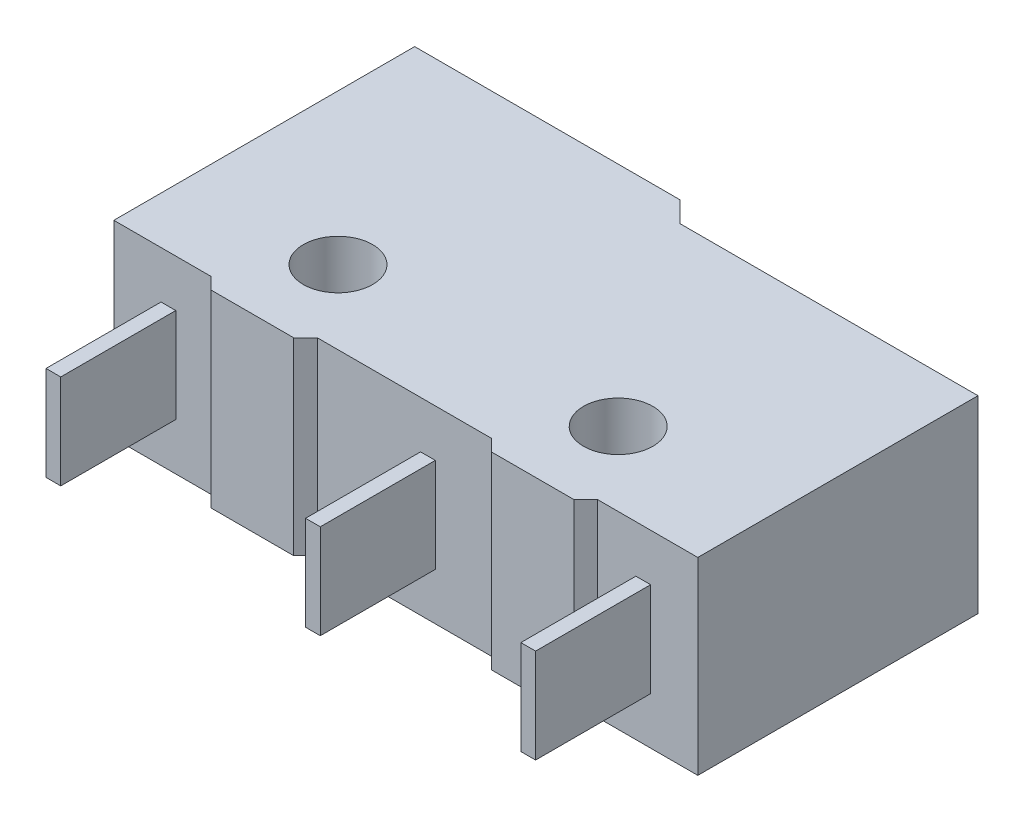
ISO-10303-21;
HEADER;
FILE_DESCRIPTION(('STEP AP214'),'2;1');
FILE_NAME('part.step','',(''),(''),'','','');
FILE_SCHEMA(('AUTOMOTIVE_DESIGN { 1 0 10303 214 1 1 1 1 }'));
ENDSEC;
DATA;
#1=APPLICATION_CONTEXT('core data for automotive mechanical design processes');
#2=APPLICATION_PROTOCOL_DEFINITION('international standard','automotive_design',2000,#1);
#3=PRODUCT_CONTEXT('',#1,'mechanical');
#4=PRODUCT('Part','Part','',(#3));
#5=PRODUCT_RELATED_PRODUCT_CATEGORY('part','',(#4));
#6=PRODUCT_DEFINITION_FORMATION('','',#4);
#7=PRODUCT_DEFINITION_CONTEXT('part definition',#1,'design');
#8=PRODUCT_DEFINITION('design','',#6,#7);
#9=PRODUCT_DEFINITION_SHAPE('','',#8);
#10=(LENGTH_UNIT() NAMED_UNIT(*) SI_UNIT(.MILLI.,.METRE.));
#11=(NAMED_UNIT(*) PLANE_ANGLE_UNIT() SI_UNIT($,.RADIAN.));
#12=(NAMED_UNIT(*) SI_UNIT($,.STERADIAN.) SOLID_ANGLE_UNIT());
#13=UNCERTAINTY_MEASURE_WITH_UNIT(LENGTH_MEASURE(1.E-05),#10,'distance_accuracy_value','');
#14=(GEOMETRIC_REPRESENTATION_CONTEXT(3) GLOBAL_UNCERTAINTY_ASSIGNED_CONTEXT((#13)) GLOBAL_UNIT_ASSIGNED_CONTEXT((#10,
#11,#12)) REPRESENTATION_CONTEXT('',''));
#15=CARTESIAN_POINT('',(0.,0.,0.));
#16=DIRECTION('',(0.,0.,1.));
#17=DIRECTION('',(1.,0.,0.));
#18=AXIS2_PLACEMENT_3D('',#15,#16,#17);
#19=CARTESIAN_POINT('',(11.3,6.4,2.5));
#20=DIRECTION('',(0.,0.,-1.));
#21=DIRECTION('',(-1.,0.,0.));
#22=AXIS2_PLACEMENT_3D('',#19,#20,#21);
#23=PLANE('',#22);
#24=DIRECTION('',(1.,0.,0.));
#25=VECTOR('',#24,1.);
#26=CARTESIAN_POINT('',(11.3,0.,2.5));
#27=LINE('',#26,#25);
#28=CARTESIAN_POINT('',(11.3,0.,2.5));
#29=VERTEX_POINT('',#28);
#30=CARTESIAN_POINT('',(14.7,0.,2.5));
#31=VERTEX_POINT('',#30);
#32=EDGE_CURVE('E499',#29,#31,#27,.T.);
#33=ORIENTED_EDGE('',*,*,#32,.T.);
#34=DIRECTION('',(0.,-1.,0.));
#35=VECTOR('',#34,1.);
#36=CARTESIAN_POINT('',(14.7,6.4,2.5));
#37=LINE('',#36,#35);
#38=CARTESIAN_POINT('',(14.7,6.4,2.5));
#39=VERTEX_POINT('',#38);
#40=EDGE_CURVE('E502',#39,#31,#37,.T.);
#41=ORIENTED_EDGE('',*,*,#40,.F.);
#42=DIRECTION('',(1.,0.,0.));
#43=VECTOR('',#42,1.);
#44=CARTESIAN_POINT('',(11.3,6.4,2.5));
#45=LINE('',#44,#43);
#46=CARTESIAN_POINT('',(11.3,6.4,2.5));
#47=VERTEX_POINT('',#46);
#48=EDGE_CURVE('E506',#47,#39,#45,.T.);
#49=ORIENTED_EDGE('',*,*,#48,.F.);
#50=DIRECTION('',(0.,-1.,0.));
#51=VECTOR('',#50,1.);
#52=CARTESIAN_POINT('',(11.3,6.4,2.5));
#53=LINE('',#52,#51);
#54=EDGE_CURVE('E505',#47,#29,#53,.T.);
#55=ORIENTED_EDGE('',*,*,#54,.T.);
#56=EDGE_LOOP('',(#33,#41,#49,#55));
#57=FACE_BOUND('',#56,.T.);
#58=DIRECTION('',(-1.,0.,0.));
#59=VECTOR('',#58,1.);
#60=CARTESIAN_POINT('',(12.6,1.6,2.5));
#61=LINE('',#60,#59);
#62=CARTESIAN_POINT('',(13.1,1.6,2.5));
#63=VERTEX_POINT('',#62);
#64=CARTESIAN_POINT('',(12.6,1.6,2.5));
#65=VERTEX_POINT('',#64);
#66=EDGE_CURVE('E265',#63,#65,#61,.T.);
#67=ORIENTED_EDGE('',*,*,#66,.T.);
#68=DIRECTION('',(0.,1.,0.));
#69=VECTOR('',#68,1.);
#70=CARTESIAN_POINT('',(12.6,1.6,2.5));
#71=LINE('',#70,#69);
#72=CARTESIAN_POINT('',(12.6,4.8,2.5));
#73=VERTEX_POINT('',#72);
#74=EDGE_CURVE('E249',#65,#73,#71,.T.);
#75=ORIENTED_EDGE('',*,*,#74,.T.);
#76=DIRECTION('',(-1.,0.,0.));
#77=VECTOR('',#76,1.);
#78=CARTESIAN_POINT('',(12.6,4.8,2.5));
#79=LINE('',#78,#77);
#80=CARTESIAN_POINT('',(13.1,4.8,2.5));
#81=VERTEX_POINT('',#80);
#82=EDGE_CURVE('E269',#81,#73,#79,.T.);
#83=ORIENTED_EDGE('',*,*,#82,.F.);
#84=DIRECTION('',(0.,1.,0.));
#85=VECTOR('',#84,1.);
#86=CARTESIAN_POINT('',(13.1,1.6,2.5));
#87=LINE('',#86,#85);
#88=EDGE_CURVE('E258',#63,#81,#87,.T.);
#89=ORIENTED_EDGE('',*,*,#88,.F.);
#90=EDGE_LOOP('',(#67,#75,#83,#89));
#91=FACE_BOUND('',#90,.T.);
#92=ADVANCED_FACE('F49',(#57,#91),#23,.F.);
#93=CARTESIAN_POINT('',(7.7,6.4,2.5));
#94=DIRECTION('',(0.,0.,-1.));
#95=DIRECTION('',(-1.,0.,0.));
#96=AXIS2_PLACEMENT_3D('',#93,#94,#95);
#97=PLANE('',#96);
#98=DIRECTION('',(1.,0.,0.));
#99=VECTOR('',#98,1.);
#100=CARTESIAN_POINT('',(7.7,0.,2.5));
#101=LINE('',#100,#99);
#102=CARTESIAN_POINT('',(1.8,0.,2.5));
#103=VERTEX_POINT('',#102);
#104=CARTESIAN_POINT('',(7.7,0.,2.5));
#105=VERTEX_POINT('',#104);
#106=EDGE_CURVE('E490',#103,#105,#101,.T.);
#107=ORIENTED_EDGE('',*,*,#106,.T.);
#108=DIRECTION('',(0.,-1.,0.));
#109=VECTOR('',#108,1.);
#110=CARTESIAN_POINT('',(7.7,6.4,2.5));
#111=LINE('',#110,#109);
#112=CARTESIAN_POINT('',(7.7,6.4,2.5));
#113=VERTEX_POINT('',#112);
#114=EDGE_CURVE('E515',#113,#105,#111,.T.);
#115=ORIENTED_EDGE('',*,*,#114,.F.);
#116=DIRECTION('',(1.,0.,0.));
#117=VECTOR('',#116,1.);
#118=CARTESIAN_POINT('',(7.7,6.4,2.5));
#119=LINE('',#118,#117);
#120=CARTESIAN_POINT('',(1.8,6.4,2.5));
#121=VERTEX_POINT('',#120);
#122=EDGE_CURVE('E556',#121,#113,#119,.T.);
#123=ORIENTED_EDGE('',*,*,#122,.F.);
#124=DIRECTION('',(0.,-1.,0.));
#125=VECTOR('',#124,1.);
#126=CARTESIAN_POINT('',(1.8,6.4,2.5));
#127=LINE('',#126,#125);
#128=EDGE_CURVE('E518',#121,#103,#127,.T.);
#129=ORIENTED_EDGE('',*,*,#128,.T.);
#130=EDGE_LOOP('',(#107,#115,#123,#129));
#131=FACE_BOUND('',#130,.T.);
#132=DIRECTION('',(-1.,0.,0.));
#133=VECTOR('',#132,1.);
#134=CARTESIAN_POINT('',(5.3,1.6,2.5));
#135=LINE('',#134,#133);
#136=CARTESIAN_POINT('',(5.8,1.6,2.5));
#137=VERTEX_POINT('',#136);
#138=CARTESIAN_POINT('',(5.3,1.6,2.5));
#139=VERTEX_POINT('',#138);
#140=EDGE_CURVE('E288',#137,#139,#135,.T.);
#141=ORIENTED_EDGE('',*,*,#140,.T.);
#142=DIRECTION('',(0.,1.,0.));
#143=VECTOR('',#142,1.);
#144=CARTESIAN_POINT('',(5.3,1.6,2.5));
#145=LINE('',#144,#143);
#146=CARTESIAN_POINT('',(5.3,4.8,2.5));
#147=VERTEX_POINT('',#146);
#148=EDGE_CURVE('E285',#139,#147,#145,.T.);
#149=ORIENTED_EDGE('',*,*,#148,.T.);
#150=DIRECTION('',(-1.,0.,0.));
#151=VECTOR('',#150,1.);
#152=CARTESIAN_POINT('',(5.3,4.8,2.5));
#153=LINE('',#152,#151);
#154=CARTESIAN_POINT('',(5.8,4.8,2.5));
#155=VERTEX_POINT('',#154);
#156=EDGE_CURVE('E305',#155,#147,#153,.T.);
#157=ORIENTED_EDGE('',*,*,#156,.F.);
#158=DIRECTION('',(0.,1.,0.));
#159=VECTOR('',#158,1.);
#160=CARTESIAN_POINT('',(5.8,1.6,2.5));
#161=LINE('',#160,#159);
#162=EDGE_CURVE('E291',#137,#155,#161,.T.);
#163=ORIENTED_EDGE('',*,*,#162,.F.);
#164=EDGE_LOOP('',(#141,#149,#157,#163));
#165=FACE_BOUND('',#164,.T.);
#166=ADVANCED_FACE('F406',(#131,#165),#97,.F.);
#167=CARTESIAN_POINT('',(-1.8,6.4,2.5));
#168=DIRECTION('',(0.,0.,-1.));
#169=DIRECTION('',(-1.,0.,0.));
#170=AXIS2_PLACEMENT_3D('',#167,#168,#169);
#171=PLANE('',#170);
#172=DIRECTION('',(1.,0.,0.));
#173=VECTOR('',#172,1.);
#174=CARTESIAN_POINT('',(-1.8,0.,2.5));
#175=LINE('',#174,#173);
#176=CARTESIAN_POINT('',(-5.1,0.,2.5));
#177=VERTEX_POINT('',#176);
#178=CARTESIAN_POINT('',(-1.8,0.,2.5));
#179=VERTEX_POINT('',#178);
#180=EDGE_CURVE('E481',#177,#179,#175,.T.);
#181=ORIENTED_EDGE('',*,*,#180,.T.);
#182=DIRECTION('',(0.,-1.,0.));
#183=VECTOR('',#182,1.);
#184=CARTESIAN_POINT('',(-1.8,6.4,2.5));
#185=LINE('',#184,#183);
#186=CARTESIAN_POINT('',(-1.8,6.4,2.5));
#187=VERTEX_POINT('',#186);
#188=EDGE_CURVE('E527',#187,#179,#185,.T.);
#189=ORIENTED_EDGE('',*,*,#188,.F.);
#190=DIRECTION('',(1.,0.,0.));
#191=VECTOR('',#190,1.);
#192=CARTESIAN_POINT('',(-1.8,6.4,2.5));
#193=LINE('',#192,#191);
#194=CARTESIAN_POINT('',(-5.1,6.4,2.5));
#195=VERTEX_POINT('',#194);
#196=EDGE_CURVE('E543',#195,#187,#193,.T.);
#197=ORIENTED_EDGE('',*,*,#196,.F.);
#198=DIRECTION('',(0.,-1.,0.));
#199=VECTOR('',#198,1.);
#200=CARTESIAN_POINT('',(-5.1,6.4,2.5));
#201=LINE('',#200,#199);
#202=EDGE_CURVE('E530',#195,#177,#201,.T.);
#203=ORIENTED_EDGE('',*,*,#202,.T.);
#204=EDGE_LOOP('',(#181,#189,#197,#203));
#205=FACE_BOUND('',#204,.T.);
#206=DIRECTION('',(-1.,0.,0.));
#207=VECTOR('',#206,1.);
#208=CARTESIAN_POINT('',(-3.5,1.6,2.5));
#209=LINE('',#208,#207);
#210=CARTESIAN_POINT('',(-3.,1.6,2.5));
#211=VERTEX_POINT('',#210);
#212=CARTESIAN_POINT('',(-3.5,1.6,2.5));
#213=VERTEX_POINT('',#212);
#214=EDGE_CURVE('E331',#211,#213,#209,.T.);
#215=ORIENTED_EDGE('',*,*,#214,.T.);
#216=DIRECTION('',(0.,1.,0.));
#217=VECTOR('',#216,1.);
#218=CARTESIAN_POINT('',(-3.5,1.6,2.5));
#219=LINE('',#218,#217);
#220=CARTESIAN_POINT('',(-3.5,4.8,2.5));
#221=VERTEX_POINT('',#220);
#222=EDGE_CURVE('E335',#213,#221,#219,.T.);
#223=ORIENTED_EDGE('',*,*,#222,.T.);
#224=DIRECTION('',(-1.,0.,0.));
#225=VECTOR('',#224,1.);
#226=CARTESIAN_POINT('',(-3.5,4.8,2.5));
#227=LINE('',#226,#225);
#228=CARTESIAN_POINT('',(-3.,4.8,2.5));
#229=VERTEX_POINT('',#228);
#230=EDGE_CURVE('E321',#229,#221,#227,.T.);
#231=ORIENTED_EDGE('',*,*,#230,.F.);
#232=DIRECTION('',(0.,1.,0.));
#233=VECTOR('',#232,1.);
#234=CARTESIAN_POINT('',(-3.,1.6,2.5));
#235=LINE('',#234,#233);
#236=EDGE_CURVE('E339',#211,#229,#235,.T.);
#237=ORIENTED_EDGE('',*,*,#236,.F.);
#238=EDGE_LOOP('',(#215,#223,#231,#237));
#239=FACE_BOUND('',#238,.T.);
#240=ADVANCED_FACE('F422',(#205,#239),#171,.F.);
#241=CARTESIAN_POINT('',(-5.1,6.4,-7.7));
#242=DIRECTION('',(0.,0.,1.));
#243=DIRECTION('',(1.,0.,0.));
#244=AXIS2_PLACEMENT_3D('',#241,#242,#243);
#245=PLANE('',#244);
#246=DIRECTION('',(-1.,0.,0.));
#247=VECTOR('',#246,1.);
#248=CARTESIAN_POINT('',(-5.1,0.,-7.7));
#249=LINE('',#248,#247);
#250=CARTESIAN_POINT('',(3.9,0.,-7.7));
#251=VERTEX_POINT('',#250);
#252=CARTESIAN_POINT('',(-5.1,0.,-7.7));
#253=VERTEX_POINT('',#252);
#254=EDGE_CURVE('E474',#251,#253,#249,.T.);
#255=ORIENTED_EDGE('',*,*,#254,.T.);
#256=DIRECTION('',(0.,-1.,0.));
#257=VECTOR('',#256,1.);
#258=CARTESIAN_POINT('',(-5.1,6.4,-7.7));
#259=LINE('',#258,#257);
#260=CARTESIAN_POINT('',(-5.1,6.4,-7.7));
#261=VERTEX_POINT('',#260);
#262=EDGE_CURVE('E533',#261,#253,#259,.T.);
#263=ORIENTED_EDGE('',*,*,#262,.F.);
#264=DIRECTION('',(-1.,0.,0.));
#265=VECTOR('',#264,1.);
#266=CARTESIAN_POINT('',(-5.1,6.4,-7.7));
#267=LINE('',#266,#265);
#268=CARTESIAN_POINT('',(3.9,6.4,-7.7));
#269=VERTEX_POINT('',#268);
#270=EDGE_CURVE('E539',#269,#261,#267,.T.);
#271=ORIENTED_EDGE('',*,*,#270,.F.);
#272=DIRECTION('',(0.,-1.,0.));
#273=VECTOR('',#272,1.);
#274=CARTESIAN_POINT('',(3.9,6.4,-7.7));
#275=LINE('',#274,#273);
#276=EDGE_CURVE('E470',#269,#251,#275,.T.);
#277=ORIENTED_EDGE('',*,*,#276,.T.);
#278=EDGE_LOOP('',(#255,#263,#271,#277));
#279=FACE_BOUND('',#278,.T.);
#280=DIRECTION('',(1.,0.,0.));
#281=VECTOR('',#280,1.);
#282=CARTESIAN_POINT('',(3.,1.6,-7.7));
#283=LINE('',#282,#281);
#284=CARTESIAN_POINT('',(1.,1.6,-7.7));
#285=VERTEX_POINT('',#284);
#286=CARTESIAN_POINT('',(3.,1.6,-7.7));
#287=VERTEX_POINT('',#286);
#288=EDGE_CURVE('E649',#285,#287,#283,.T.);
#289=ORIENTED_EDGE('',*,*,#288,.T.);
#290=DIRECTION('',(0.,1.,0.));
#291=VECTOR('',#290,1.);
#292=CARTESIAN_POINT('',(3.,1.6,-7.7));
#293=LINE('',#292,#291);
#294=CARTESIAN_POINT('',(3.,4.8,-7.7));
#295=VERTEX_POINT('',#294);
#296=EDGE_CURVE('E653',#287,#295,#293,.T.);
#297=ORIENTED_EDGE('',*,*,#296,.T.);
#298=DIRECTION('',(1.,0.,0.));
#299=VECTOR('',#298,1.);
#300=CARTESIAN_POINT('',(3.,4.8,-7.7));
#301=LINE('',#300,#299);
#302=CARTESIAN_POINT('',(1.,4.8,-7.7));
#303=VERTEX_POINT('',#302);
#304=EDGE_CURVE('E357',#303,#295,#301,.T.);
#305=ORIENTED_EDGE('',*,*,#304,.F.);
#306=DIRECTION('',(0.,1.,0.));
#307=VECTOR('',#306,1.);
#308=CARTESIAN_POINT('',(1.,1.6,-7.7));
#309=LINE('',#308,#307);
#310=EDGE_CURVE('E655',#285,#303,#309,.T.);
#311=ORIENTED_EDGE('',*,*,#310,.F.);
#312=EDGE_LOOP('',(#289,#297,#305,#311));
#313=FACE_BOUND('',#312,.T.);
#314=ADVANCED_FACE('F399',(#279,#313),#245,.F.);
#315=CARTESIAN_POINT('',(0.,6.4,0.));
#316=DIRECTION('',(0.,-1.,0.));
#317=DIRECTION('',(0.,0.,-1.));
#318=AXIS2_PLACEMENT_3D('',#315,#316,#317);
#319=PLANE('',#318);
#320=DIRECTION('',(0.,0.,-1.));
#321=VECTOR('',#320,1.);
#322=CARTESIAN_POINT('',(14.7,6.4,2.5));
#323=LINE('',#322,#321);
#324=CARTESIAN_POINT('',(14.7,6.4,-7.));
#325=VERTEX_POINT('',#324);
#326=EDGE_CURVE('E501',#39,#325,#323,.T.);
#327=ORIENTED_EDGE('',*,*,#326,.T.);
#328=DIRECTION('',(-1.,0.,0.));
#329=VECTOR('',#328,1.);
#330=CARTESIAN_POINT('',(4.59999999999999,6.4,-7.));
#331=LINE('',#330,#329);
#332=CARTESIAN_POINT('',(4.59999999999999,6.4,-7.));
#333=VERTEX_POINT('',#332);
#334=EDGE_CURVE('E545',#325,#333,#331,.T.);
#335=ORIENTED_EDGE('',*,*,#334,.T.);
#336=DIRECTION('',(-0.707106781186544,0.,-0.707106781186551));
#337=VECTOR('',#336,1.);
#338=CARTESIAN_POINT('',(3.9,6.4,-7.7));
#339=LINE('',#338,#337);
#340=EDGE_CURVE('E469',#333,#269,#339,.T.);
#341=ORIENTED_EDGE('',*,*,#340,.T.);
#342=ORIENTED_EDGE('',*,*,#270,.T.);
#343=DIRECTION('',(0.,0.,1.));
#344=VECTOR('',#343,1.);
#345=CARTESIAN_POINT('',(-5.1,6.4,2.5));
#346=LINE('',#345,#344);
#347=EDGE_CURVE('E541',#261,#195,#346,.T.);
#348=ORIENTED_EDGE('',*,*,#347,.T.);
#349=ORIENTED_EDGE('',*,*,#196,.T.);
#350=DIRECTION('',(0.707106781186546,0.,0.707106781186549));
#351=VECTOR('',#350,1.);
#352=CARTESIAN_POINT('',(-1.4,6.4,2.9));
#353=LINE('',#352,#351);
#354=CARTESIAN_POINT('',(-1.4,6.4,2.9));
#355=VERTEX_POINT('',#354);
#356=EDGE_CURVE('E550',#187,#355,#353,.T.);
#357=ORIENTED_EDGE('',*,*,#356,.T.);
#358=DIRECTION('',(1.,0.,0.));
#359=VECTOR('',#358,1.);
#360=CARTESIAN_POINT('',(0.,6.4,2.9));
#361=LINE('',#360,#359);
#362=CARTESIAN_POINT('',(1.4,6.4,2.9));
#363=VERTEX_POINT('',#362);
#364=EDGE_CURVE('E552',#355,#363,#361,.T.);
#365=ORIENTED_EDGE('',*,*,#364,.T.);
#366=DIRECTION('',(0.707106781186546,0.,-0.707106781186549));
#367=VECTOR('',#366,1.);
#368=CARTESIAN_POINT('',(1.4,6.4,2.9));
#369=LINE('',#368,#367);
#370=EDGE_CURVE('E554',#363,#121,#369,.T.);
#371=ORIENTED_EDGE('',*,*,#370,.T.);
#372=ORIENTED_EDGE('',*,*,#122,.T.);
#373=DIRECTION('',(0.707106781186548,0.,0.707106781186547));
#374=VECTOR('',#373,1.);
#375=CARTESIAN_POINT('',(8.1,6.4,2.9));
#376=LINE('',#375,#374);
#377=CARTESIAN_POINT('',(8.1,6.4,2.9));
#378=VERTEX_POINT('',#377);
#379=EDGE_CURVE('E558',#113,#378,#376,.T.);
#380=ORIENTED_EDGE('',*,*,#379,.T.);
#381=DIRECTION('',(1.,0.,0.));
#382=VECTOR('',#381,1.);
#383=CARTESIAN_POINT('',(9.5,6.4,2.9));
#384=LINE('',#383,#382);
#385=CARTESIAN_POINT('',(10.9,6.4,2.9));
#386=VERTEX_POINT('',#385);
#387=EDGE_CURVE('E560',#378,#386,#384,.T.);
#388=ORIENTED_EDGE('',*,*,#387,.T.);
#389=DIRECTION('',(0.707106781186545,0.,-0.707106781186549));
#390=VECTOR('',#389,1.);
#391=CARTESIAN_POINT('',(10.9,6.4,2.9));
#392=LINE('',#391,#390);
#393=EDGE_CURVE('E562',#386,#47,#392,.T.);
#394=ORIENTED_EDGE('',*,*,#393,.T.);
#395=ORIENTED_EDGE('',*,*,#48,.T.);
#396=EDGE_LOOP('',(#327,#335,#341,#342,#348,#349,#357,#365,#371,#372,#380,#388,#394,#395));
#397=FACE_BOUND('',#396,.T.);
#398=CARTESIAN_POINT('',(0.,6.4,0.));
#399=DIRECTION('',(0.,1.,0.));
#400=DIRECTION('',(0.,0.,1.));
#401=AXIS2_PLACEMENT_3D('',#398,#399,#400);
#402=CIRCLE('',#401,1.175);
#403=CARTESIAN_POINT('',(0.,6.4,1.175));
#404=VERTEX_POINT('',#403);
#405=EDGE_CURVE('E564',#404,#404,#402,.T.);
#406=ORIENTED_EDGE('',*,*,#405,.F.);
#407=EDGE_LOOP('',(#406));
#408=FACE_BOUND('',#407,.T.);
#409=CARTESIAN_POINT('',(9.5,6.4,0.));
#410=DIRECTION('',(0.,1.,0.));
#411=DIRECTION('',(0.,0.,1.));
#412=AXIS2_PLACEMENT_3D('',#409,#410,#411);
#413=CIRCLE('',#412,1.175);
#414=CARTESIAN_POINT('',(9.5,6.4,1.175));
#415=VERTEX_POINT('',#414);
#416=EDGE_CURVE('E570',#415,#415,#413,.T.);
#417=ORIENTED_EDGE('',*,*,#416,.F.);
#418=EDGE_LOOP('',(#417));
#419=FACE_BOUND('',#418,.T.);
#420=ADVANCED_FACE('F395',(#397,#408,#419),#319,.F.);
#421=CARTESIAN_POINT('',(0.,0.,0.));
#422=DIRECTION('',(0.,-1.,0.));
#423=DIRECTION('',(0.,0.,-1.));
#424=AXIS2_PLACEMENT_3D('',#421,#422,#423);
#425=PLANE('',#424);
#426=CARTESIAN_POINT('',(0.,0.,0.));
#427=DIRECTION('',(0.,1.,0.));
#428=DIRECTION('',(0.,0.,1.));
#429=AXIS2_PLACEMENT_3D('',#426,#427,#428);
#430=CIRCLE('',#429,1.175);
#431=CARTESIAN_POINT('',(0.,0.,1.175));
#432=VERTEX_POINT('',#431);
#433=EDGE_CURVE('E566',#432,#432,#430,.T.);
#434=ORIENTED_EDGE('',*,*,#433,.T.);
#435=EDGE_LOOP('',(#434));
#436=FACE_BOUND('',#435,.T.);
#437=DIRECTION('',(0.,0.,-1.));
#438=VECTOR('',#437,1.);
#439=CARTESIAN_POINT('',(14.7,0.,2.5));
#440=LINE('',#439,#438);
#441=CARTESIAN_POINT('',(14.7,0.,-7.));
#442=VERTEX_POINT('',#441);
#443=EDGE_CURVE('E465',#31,#442,#440,.T.);
#444=ORIENTED_EDGE('',*,*,#443,.F.);
#445=ORIENTED_EDGE('',*,*,#32,.F.);
#446=DIRECTION('',(0.707106781186545,0.,-0.707106781186549));
#447=VECTOR('',#446,1.);
#448=CARTESIAN_POINT('',(10.9,0.,2.9));
#449=LINE('',#448,#447);
#450=CARTESIAN_POINT('',(10.9,0.,2.9));
#451=VERTEX_POINT('',#450);
#452=EDGE_CURVE('E497',#451,#29,#449,.T.);
#453=ORIENTED_EDGE('',*,*,#452,.F.);
#454=DIRECTION('',(1.,0.,0.));
#455=VECTOR('',#454,1.);
#456=CARTESIAN_POINT('',(9.5,0.,2.9));
#457=LINE('',#456,#455);
#458=CARTESIAN_POINT('',(8.1,0.,2.9));
#459=VERTEX_POINT('',#458);
#460=EDGE_CURVE('E495',#459,#451,#457,.T.);
#461=ORIENTED_EDGE('',*,*,#460,.F.);
#462=DIRECTION('',(0.707106781186548,0.,0.707106781186547));
#463=VECTOR('',#462,1.);
#464=CARTESIAN_POINT('',(8.1,0.,2.9));
#465=LINE('',#464,#463);
#466=EDGE_CURVE('E492',#105,#459,#465,.T.);
#467=ORIENTED_EDGE('',*,*,#466,.F.);
#468=ORIENTED_EDGE('',*,*,#106,.F.);
#469=DIRECTION('',(0.707106781186546,0.,-0.707106781186549));
#470=VECTOR('',#469,1.);
#471=CARTESIAN_POINT('',(1.4,0.,2.9));
#472=LINE('',#471,#470);
#473=CARTESIAN_POINT('',(1.4,0.,2.9));
#474=VERTEX_POINT('',#473);
#475=EDGE_CURVE('E488',#474,#103,#472,.T.);
#476=ORIENTED_EDGE('',*,*,#475,.F.);
#477=DIRECTION('',(1.,0.,0.));
#478=VECTOR('',#477,1.);
#479=CARTESIAN_POINT('',(0.,0.,2.9));
#480=LINE('',#479,#478);
#481=CARTESIAN_POINT('',(-1.4,0.,2.9));
#482=VERTEX_POINT('',#481);
#483=EDGE_CURVE('E486',#482,#474,#480,.T.);
#484=ORIENTED_EDGE('',*,*,#483,.F.);
#485=DIRECTION('',(0.707106781186546,0.,0.707106781186549));
#486=VECTOR('',#485,1.);
#487=CARTESIAN_POINT('',(-1.4,0.,2.9));
#488=LINE('',#487,#486);
#489=EDGE_CURVE('E483',#179,#482,#488,.T.);
#490=ORIENTED_EDGE('',*,*,#489,.F.);
#491=ORIENTED_EDGE('',*,*,#180,.F.);
#492=DIRECTION('',(0.,0.,1.));
#493=VECTOR('',#492,1.);
#494=CARTESIAN_POINT('',(-5.1,0.,2.5));
#495=LINE('',#494,#493);
#496=EDGE_CURVE('E476',#253,#177,#495,.T.);
#497=ORIENTED_EDGE('',*,*,#496,.F.);
#498=ORIENTED_EDGE('',*,*,#254,.F.);
#499=DIRECTION('',(-0.707106781186544,0.,-0.707106781186551));
#500=VECTOR('',#499,1.);
#501=CARTESIAN_POINT('',(3.9,0.,-7.7));
#502=LINE('',#501,#500);
#503=CARTESIAN_POINT('',(4.59999999999999,0.,-7.));
#504=VERTEX_POINT('',#503);
#505=EDGE_CURVE('E464',#504,#251,#502,.T.);
#506=ORIENTED_EDGE('',*,*,#505,.F.);
#507=DIRECTION('',(-1.,0.,0.));
#508=VECTOR('',#507,1.);
#509=CARTESIAN_POINT('',(4.59999999999999,0.,-7.));
#510=LINE('',#509,#508);
#511=EDGE_CURVE('E456',#442,#504,#510,.T.);
#512=ORIENTED_EDGE('',*,*,#511,.F.);
#513=EDGE_LOOP('',(#444,#445,#453,#461,#467,#468,#476,#484,#490,#491,#497,#498,#506,#512));
#514=FACE_BOUND('',#513,.T.);
#515=CARTESIAN_POINT('',(9.5,0.,0.));
#516=DIRECTION('',(0.,1.,0.));
#517=DIRECTION('',(0.,0.,1.));
#518=AXIS2_PLACEMENT_3D('',#515,#516,#517);
#519=CIRCLE('',#518,1.175);
#520=CARTESIAN_POINT('',(9.5,0.,1.175));
#521=VERTEX_POINT('',#520);
#522=EDGE_CURVE('E573',#521,#521,#519,.T.);
#523=ORIENTED_EDGE('',*,*,#522,.T.);
#524=EDGE_LOOP('',(#523));
#525=FACE_BOUND('',#524,.T.);
#526=ADVANCED_FACE('F398',(#436,#514,#525),#425,.T.);
#527=CARTESIAN_POINT('',(14.7,6.4,2.5));
#528=DIRECTION('',(-1.,0.,0.));
#529=DIRECTION('',(0.,0.,1.));
#530=AXIS2_PLACEMENT_3D('',#527,#528,#529);
#531=PLANE('',#530);
#532=ORIENTED_EDGE('',*,*,#443,.T.);
#533=DIRECTION('',(0.,-1.,0.));
#534=VECTOR('',#533,1.);
#535=CARTESIAN_POINT('',(14.7,6.4,-7.));
#536=LINE('',#535,#534);
#537=EDGE_CURVE('E11',#325,#442,#536,.T.);
#538=ORIENTED_EDGE('',*,*,#537,.F.);
#539=ORIENTED_EDGE('',*,*,#326,.F.);
#540=ORIENTED_EDGE('',*,*,#40,.T.);
#541=EDGE_LOOP('',(#532,#538,#539,#540));
#542=FACE_BOUND('',#541,.T.);
#543=ADVANCED_FACE('F51',(#542),#531,.F.);
#544=CARTESIAN_POINT('',(4.59999999999999,6.4,-7.));
#545=DIRECTION('',(0.,0.,1.));
#546=DIRECTION('',(1.,0.,0.));
#547=AXIS2_PLACEMENT_3D('',#544,#545,#546);
#548=PLANE('',#547);
#549=ORIENTED_EDGE('',*,*,#511,.T.);
#550=DIRECTION('',(0.,-1.,0.));
#551=VECTOR('',#550,1.);
#552=CARTESIAN_POINT('',(4.59999999999999,6.4,-7.));
#553=LINE('',#552,#551);
#554=EDGE_CURVE('E57',#333,#504,#553,.T.);
#555=ORIENTED_EDGE('',*,*,#554,.F.);
#556=ORIENTED_EDGE('',*,*,#334,.F.);
#557=ORIENTED_EDGE('',*,*,#537,.T.);
#558=EDGE_LOOP('',(#549,#555,#556,#557));
#559=FACE_BOUND('',#558,.T.);
#560=ADVANCED_FACE('F447',(#559),#548,.F.);
#561=CARTESIAN_POINT('',(3.9,6.4,-7.7));
#562=DIRECTION('',(-0.707106781186551,0.,0.707106781186545));
#563=DIRECTION('',(0.707106781186545,0.,0.707106781186551));
#564=AXIS2_PLACEMENT_3D('',#561,#562,#563);
#565=PLANE('',#564);
#566=ORIENTED_EDGE('',*,*,#505,.T.);
#567=ORIENTED_EDGE('',*,*,#276,.F.);
#568=ORIENTED_EDGE('',*,*,#340,.F.);
#569=ORIENTED_EDGE('',*,*,#554,.T.);
#570=EDGE_LOOP('',(#566,#567,#568,#569));
#571=FACE_BOUND('',#570,.T.);
#572=ADVANCED_FACE('F441',(#571),#565,.F.);
#573=CARTESIAN_POINT('',(-5.1,6.4,2.5));
#574=DIRECTION('',(1.,0.,0.));
#575=DIRECTION('',(0.,0.,-1.));
#576=AXIS2_PLACEMENT_3D('',#573,#574,#575);
#577=PLANE('',#576);
#578=ORIENTED_EDGE('',*,*,#496,.T.);
#579=ORIENTED_EDGE('',*,*,#202,.F.);
#580=ORIENTED_EDGE('',*,*,#347,.F.);
#581=ORIENTED_EDGE('',*,*,#262,.T.);
#582=EDGE_LOOP('',(#578,#579,#580,#581));
#583=FACE_BOUND('',#582,.T.);
#584=ADVANCED_FACE('F434',(#583),#577,.F.);
#585=CARTESIAN_POINT('',(-1.4,6.4,2.9));
#586=DIRECTION('',(0.707106781186549,0.,-0.707106781186546));
#587=DIRECTION('',(-0.707106781186546,0.,-0.707106781186549));
#588=AXIS2_PLACEMENT_3D('',#585,#586,#587);
#589=PLANE('',#588);
#590=ORIENTED_EDGE('',*,*,#489,.T.);
#591=DIRECTION('',(0.,-1.,0.));
#592=VECTOR('',#591,1.);
#593=CARTESIAN_POINT('',(-1.4,6.4,2.9));
#594=LINE('',#593,#592);
#595=EDGE_CURVE('E524',#355,#482,#594,.T.);
#596=ORIENTED_EDGE('',*,*,#595,.F.);
#597=ORIENTED_EDGE('',*,*,#356,.F.);
#598=ORIENTED_EDGE('',*,*,#188,.T.);
#599=EDGE_LOOP('',(#590,#596,#597,#598));
#600=FACE_BOUND('',#599,.T.);
#601=ADVANCED_FACE('F430',(#600),#589,.F.);
#602=CARTESIAN_POINT('',(0.,6.4,2.9));
#603=DIRECTION('',(0.,0.,-1.));
#604=DIRECTION('',(-1.,0.,0.));
#605=AXIS2_PLACEMENT_3D('',#602,#603,#604);
#606=PLANE('',#605);
#607=ORIENTED_EDGE('',*,*,#483,.T.);
#608=DIRECTION('',(0.,-1.,0.));
#609=VECTOR('',#608,1.);
#610=CARTESIAN_POINT('',(1.4,6.4,2.9));
#611=LINE('',#610,#609);
#612=EDGE_CURVE('E521',#363,#474,#611,.T.);
#613=ORIENTED_EDGE('',*,*,#612,.F.);
#614=ORIENTED_EDGE('',*,*,#364,.F.);
#615=ORIENTED_EDGE('',*,*,#595,.T.);
#616=EDGE_LOOP('',(#607,#613,#614,#615));
#617=FACE_BOUND('',#616,.T.);
#618=ADVANCED_FACE('F426',(#617),#606,.F.);
#619=CARTESIAN_POINT('',(1.4,6.4,2.9));
#620=DIRECTION('',(-0.707106781186549,0.,-0.707106781186546));
#621=DIRECTION('',(-0.707106781186546,0.,0.707106781186549));
#622=AXIS2_PLACEMENT_3D('',#619,#620,#621);
#623=PLANE('',#622);
#624=ORIENTED_EDGE('',*,*,#475,.T.);
#625=ORIENTED_EDGE('',*,*,#128,.F.);
#626=ORIENTED_EDGE('',*,*,#370,.F.);
#627=ORIENTED_EDGE('',*,*,#612,.T.);
#628=EDGE_LOOP('',(#624,#625,#626,#627));
#629=FACE_BOUND('',#628,.T.);
#630=ADVANCED_FACE('F418',(#629),#623,.F.);
#631=CARTESIAN_POINT('',(8.1,6.4,2.9));
#632=DIRECTION('',(0.707106781186547,0.,-0.707106781186548));
#633=DIRECTION('',(-0.707106781186548,0.,-0.707106781186547));
#634=AXIS2_PLACEMENT_3D('',#631,#632,#633);
#635=PLANE('',#634);
#636=ORIENTED_EDGE('',*,*,#466,.T.);
#637=DIRECTION('',(0.,-1.,0.));
#638=VECTOR('',#637,1.);
#639=CARTESIAN_POINT('',(8.1,6.4,2.9));
#640=LINE('',#639,#638);
#641=EDGE_CURVE('E512',#378,#459,#640,.T.);
#642=ORIENTED_EDGE('',*,*,#641,.F.);
#643=ORIENTED_EDGE('',*,*,#379,.F.);
#644=ORIENTED_EDGE('',*,*,#114,.T.);
#645=EDGE_LOOP('',(#636,#642,#643,#644));
#646=FACE_BOUND('',#645,.T.);
#647=ADVANCED_FACE('F414',(#646),#635,.F.);
#648=CARTESIAN_POINT('',(9.5,6.4,2.9));
#649=DIRECTION('',(0.,0.,-1.));
#650=DIRECTION('',(-1.,0.,0.));
#651=AXIS2_PLACEMENT_3D('',#648,#649,#650);
#652=PLANE('',#651);
#653=ORIENTED_EDGE('',*,*,#460,.T.);
#654=DIRECTION('',(0.,-1.,0.));
#655=VECTOR('',#654,1.);
#656=CARTESIAN_POINT('',(10.9,6.4,2.9));
#657=LINE('',#656,#655);
#658=EDGE_CURVE('E509',#386,#451,#657,.T.);
#659=ORIENTED_EDGE('',*,*,#658,.F.);
#660=ORIENTED_EDGE('',*,*,#387,.F.);
#661=ORIENTED_EDGE('',*,*,#641,.T.);
#662=EDGE_LOOP('',(#653,#659,#660,#661));
#663=FACE_BOUND('',#662,.T.);
#664=ADVANCED_FACE('F410',(#663),#652,.F.);
#665=CARTESIAN_POINT('',(10.9,6.4,2.9));
#666=DIRECTION('',(-0.707106781186549,0.,-0.707106781186545));
#667=DIRECTION('',(-0.707106781186546,0.,0.70710678118655));
#668=AXIS2_PLACEMENT_3D('',#665,#666,#667);
#669=PLANE('',#668);
#670=ORIENTED_EDGE('',*,*,#452,.T.);
#671=ORIENTED_EDGE('',*,*,#54,.F.);
#672=ORIENTED_EDGE('',*,*,#393,.F.);
#673=ORIENTED_EDGE('',*,*,#658,.T.);
#674=EDGE_LOOP('',(#670,#671,#672,#673));
#675=FACE_BOUND('',#674,.T.);
#676=ADVANCED_FACE('F393',(#675),#669,.F.);
#677=CARTESIAN_POINT('',(0.,6.4,0.));
#678=DIRECTION('',(0.,-1.,0.));
#679=DIRECTION('',(0.,0.,-1.));
#680=AXIS2_PLACEMENT_3D('',#677,#678,#679);
#681=CYLINDRICAL_SURFACE('',#680,1.175);
#682=ORIENTED_EDGE('',*,*,#405,.T.);
#683=EDGE_LOOP('',(#682));
#684=FACE_BOUND('',#683,.T.);
#685=ORIENTED_EDGE('',*,*,#433,.F.);
#686=EDGE_LOOP('',(#685));
#687=FACE_BOUND('',#686,.T.);
#688=ADVANCED_FACE('F389',(#684,#687),#681,.F.);
#689=CARTESIAN_POINT('',(9.5,6.4,0.));
#690=DIRECTION('',(0.,-1.,0.));
#691=DIRECTION('',(0.,0.,-1.));
#692=AXIS2_PLACEMENT_3D('',#689,#690,#691);
#693=CYLINDRICAL_SURFACE('',#692,1.175);
#694=ORIENTED_EDGE('',*,*,#416,.T.);
#695=EDGE_LOOP('',(#694));
#696=FACE_BOUND('',#695,.T.);
#697=ORIENTED_EDGE('',*,*,#522,.F.);
#698=EDGE_LOOP('',(#697));
#699=FACE_BOUND('',#698,.T.);
#700=ADVANCED_FACE('F385',(#696,#699),#693,.F.);
#701=CARTESIAN_POINT('',(3.,1.6,-7.7));
#702=DIRECTION('',(1.,0.,0.));
#703=DIRECTION('',(0.,0.,-1.));
#704=AXIS2_PLACEMENT_3D('',#701,#702,#703);
#705=PLANE('',#704);
#706=DIRECTION('',(0.,1.,0.));
#707=VECTOR('',#706,1.);
#708=CARTESIAN_POINT('',(3.,1.6,-7.954));
#709=LINE('',#708,#707);
#710=CARTESIAN_POINT('',(3.,1.6,-7.954));
#711=VERTEX_POINT('',#710);
#712=CARTESIAN_POINT('',(3.,4.8,-7.954));
#713=VERTEX_POINT('',#712);
#714=EDGE_CURVE('E656',#711,#713,#709,.T.);
#715=ORIENTED_EDGE('',*,*,#714,.T.);
#716=DIRECTION('',(0.,0.,-1.));
#717=VECTOR('',#716,1.);
#718=CARTESIAN_POINT('',(3.,4.8,-7.7));
#719=LINE('',#718,#717);
#720=EDGE_CURVE('E338',#295,#713,#719,.T.);
#721=ORIENTED_EDGE('',*,*,#720,.F.);
#722=ORIENTED_EDGE('',*,*,#296,.F.);
#723=DIRECTION('',(0.,0.,-1.));
#724=VECTOR('',#723,1.);
#725=CARTESIAN_POINT('',(3.,1.6,-7.7));
#726=LINE('',#725,#724);
#727=EDGE_CURVE('E359',#287,#711,#726,.T.);
#728=ORIENTED_EDGE('',*,*,#727,.T.);
#729=EDGE_LOOP('',(#715,#721,#722,#728));
#730=FACE_BOUND('',#729,.T.);
#731=ADVANCED_FACE('F382',(#730),#705,.T.);
#732=CARTESIAN_POINT('',(1.,1.6,-7.7));
#733=DIRECTION('',(-1.,0.,0.));
#734=DIRECTION('',(0.,0.,1.));
#735=AXIS2_PLACEMENT_3D('',#732,#733,#734);
#736=PLANE('',#735);
#737=ORIENTED_EDGE('',*,*,#310,.T.);
#738=DIRECTION('',(0.,0.,1.));
#739=VECTOR('',#738,1.);
#740=CARTESIAN_POINT('',(1.,4.8,-7.7));
#741=LINE('',#740,#739);
#742=CARTESIAN_POINT('',(1.,4.8,-7.954));
#743=VERTEX_POINT('',#742);
#744=EDGE_CURVE('E352',#743,#303,#741,.T.);
#745=ORIENTED_EDGE('',*,*,#744,.F.);
#746=DIRECTION('',(0.,1.,0.));
#747=VECTOR('',#746,1.);
#748=CARTESIAN_POINT('',(1.,1.6,-7.954));
#749=LINE('',#748,#747);
#750=CARTESIAN_POINT('',(1.,1.6,-7.954));
#751=VERTEX_POINT('',#750);
#752=EDGE_CURVE('E657',#751,#743,#749,.T.);
#753=ORIENTED_EDGE('',*,*,#752,.F.);
#754=DIRECTION('',(0.,0.,1.));
#755=VECTOR('',#754,1.);
#756=CARTESIAN_POINT('',(1.,1.6,-7.7));
#757=LINE('',#756,#755);
#758=EDGE_CURVE('E368',#751,#285,#757,.T.);
#759=ORIENTED_EDGE('',*,*,#758,.T.);
#760=EDGE_LOOP('',(#737,#745,#753,#759));
#761=FACE_BOUND('',#760,.T.);
#762=ADVANCED_FACE('F379',(#761),#736,.T.);
#763=CARTESIAN_POINT('',(3.,1.6,-7.954));
#764=CARTESIAN_POINT('',(2.,1.6,-9.1224));
#765=CARTESIAN_POINT('',(1.,1.6,-7.954));
#766=B_SPLINE_CURVE_WITH_KNOTS('',2,(#763,#764,#765),.UNSPECIFIED.,.F.,.F.,(3,3),(0.,1.),.UNSPECIFIED.);
#767=DIRECTION('',(0.,1.,0.));
#768=VECTOR('',#767,1.);
#769=SURFACE_OF_LINEAR_EXTRUSION('',#766,#768);
#770=ORIENTED_EDGE('',*,*,#752,.T.);
#771=CARTESIAN_POINT('',(3.,4.8,-7.954));
#772=CARTESIAN_POINT('',(2.,4.8,-9.1224));
#773=CARTESIAN_POINT('',(1.,4.8,-7.954));
#774=B_SPLINE_CURVE_WITH_KNOTS('',2,(#771,#772,#773),.UNSPECIFIED.,.F.,.F.,(3,3),(0.,1.),.UNSPECIFIED.);
#775=EDGE_CURVE('E347',#713,#743,#774,.T.);
#776=ORIENTED_EDGE('',*,*,#775,.F.);
#777=ORIENTED_EDGE('',*,*,#714,.F.);
#778=EDGE_CURVE('E362',#711,#751,#766,.T.);
#779=ORIENTED_EDGE('',*,*,#778,.T.);
#780=EDGE_LOOP('',(#770,#776,#777,#779));
#781=FACE_BOUND('',#780,.T.);
#782=ADVANCED_FACE('F374',(#781),#769,.T.);
#783=CARTESIAN_POINT('',(2.,1.6,-8.5382));
#784=DIRECTION('',(0.,1.,0.));
#785=DIRECTION('',(0.,0.,1.));
#786=AXIS2_PLACEMENT_3D('',#783,#784,#785);
#787=PLANE('',#786);
#788=ORIENTED_EDGE('',*,*,#727,.F.);
#789=ORIENTED_EDGE('',*,*,#288,.F.);
#790=ORIENTED_EDGE('',*,*,#758,.F.);
#791=ORIENTED_EDGE('',*,*,#778,.F.);
#792=EDGE_LOOP('',(#788,#789,#790,#791));
#793=FACE_BOUND('',#792,.T.);
#794=ADVANCED_FACE('F378',(#793),#787,.F.);
#795=CARTESIAN_POINT('',(2.,4.8,-8.5382));
#796=DIRECTION('',(0.,1.,0.));
#797=DIRECTION('',(0.,0.,1.));
#798=AXIS2_PLACEMENT_3D('',#795,#796,#797);
#799=PLANE('',#798);
#800=ORIENTED_EDGE('',*,*,#720,.T.);
#801=ORIENTED_EDGE('',*,*,#775,.T.);
#802=ORIENTED_EDGE('',*,*,#744,.T.);
#803=ORIENTED_EDGE('',*,*,#304,.T.);
#804=EDGE_LOOP('',(#800,#801,#802,#803));
#805=FACE_BOUND('',#804,.T.);
#806=ADVANCED_FACE('F637',(#805),#799,.T.);
#807=CARTESIAN_POINT('',(-3.5,1.6,2.5));
#808=DIRECTION('',(-1.,0.,0.));
#809=DIRECTION('',(0.,0.,1.));
#810=AXIS2_PLACEMENT_3D('',#807,#808,#809);
#811=PLANE('',#810);
#812=DIRECTION('',(0.,1.,0.));
#813=VECTOR('',#812,1.);
#814=CARTESIAN_POINT('',(-3.5,1.6,6.4));
#815=LINE('',#814,#813);
#816=CARTESIAN_POINT('',(-3.5,1.6,6.4));
#817=VERTEX_POINT('',#816);
#818=CARTESIAN_POINT('',(-3.5,4.8,6.4));
#819=VERTEX_POINT('',#818);
#820=EDGE_CURVE('E334',#817,#819,#815,.T.);
#821=ORIENTED_EDGE('',*,*,#820,.T.);
#822=DIRECTION('',(0.,0.,1.));
#823=VECTOR('',#822,1.);
#824=CARTESIAN_POINT('',(-3.5,4.8,2.5));
#825=LINE('',#824,#823);
#826=EDGE_CURVE('E313',#221,#819,#825,.T.);
#827=ORIENTED_EDGE('',*,*,#826,.F.);
#828=ORIENTED_EDGE('',*,*,#222,.F.);
#829=DIRECTION('',(0.,0.,1.));
#830=VECTOR('',#829,1.);
#831=CARTESIAN_POINT('',(-3.5,1.6,2.5));
#832=LINE('',#831,#830);
#833=EDGE_CURVE('E323',#213,#817,#832,.T.);
#834=ORIENTED_EDGE('',*,*,#833,.T.);
#835=EDGE_LOOP('',(#821,#827,#828,#834));
#836=FACE_BOUND('',#835,.T.);
#837=ADVANCED_FACE('F616',(#836),#811,.T.);
#838=CARTESIAN_POINT('',(-3.,1.6,2.5));
#839=DIRECTION('',(1.,0.,0.));
#840=DIRECTION('',(0.,0.,-1.));
#841=AXIS2_PLACEMENT_3D('',#838,#839,#840);
#842=PLANE('',#841);
#843=ORIENTED_EDGE('',*,*,#236,.T.);
#844=DIRECTION('',(0.,0.,-1.));
#845=VECTOR('',#844,1.);
#846=CARTESIAN_POINT('',(-3.,4.8,2.5));
#847=LINE('',#846,#845);
#848=CARTESIAN_POINT('',(-3.,4.8,6.4));
#849=VERTEX_POINT('',#848);
#850=EDGE_CURVE('E319',#849,#229,#847,.T.);
#851=ORIENTED_EDGE('',*,*,#850,.F.);
#852=DIRECTION('',(0.,1.,0.));
#853=VECTOR('',#852,1.);
#854=CARTESIAN_POINT('',(-3.,1.6,6.4));
#855=LINE('',#854,#853);
#856=CARTESIAN_POINT('',(-3.,1.6,6.4));
#857=VERTEX_POINT('',#856);
#858=EDGE_CURVE('E342',#857,#849,#855,.T.);
#859=ORIENTED_EDGE('',*,*,#858,.F.);
#860=DIRECTION('',(0.,0.,-1.));
#861=VECTOR('',#860,1.);
#862=CARTESIAN_POINT('',(-3.,1.6,2.5));
#863=LINE('',#862,#861);
#864=EDGE_CURVE('E329',#857,#211,#863,.T.);
#865=ORIENTED_EDGE('',*,*,#864,.T.);
#866=EDGE_LOOP('',(#843,#851,#859,#865));
#867=FACE_BOUND('',#866,.T.);
#868=ADVANCED_FACE('F623',(#867),#842,.T.);
#869=CARTESIAN_POINT('',(-3.5,1.6,6.4));
#870=DIRECTION('',(0.,0.,1.));
#871=DIRECTION('',(1.,0.,0.));
#872=AXIS2_PLACEMENT_3D('',#869,#870,#871);
#873=PLANE('',#872);
#874=ORIENTED_EDGE('',*,*,#858,.T.);
#875=DIRECTION('',(1.,0.,0.));
#876=VECTOR('',#875,1.);
#877=CARTESIAN_POINT('',(-3.5,4.8,6.4));
#878=LINE('',#877,#876);
#879=EDGE_CURVE('E316',#819,#849,#878,.T.);
#880=ORIENTED_EDGE('',*,*,#879,.F.);
#881=ORIENTED_EDGE('',*,*,#820,.F.);
#882=DIRECTION('',(1.,0.,0.));
#883=VECTOR('',#882,1.);
#884=CARTESIAN_POINT('',(-3.5,1.6,6.4));
#885=LINE('',#884,#883);
#886=EDGE_CURVE('E326',#817,#857,#885,.T.);
#887=ORIENTED_EDGE('',*,*,#886,.T.);
#888=EDGE_LOOP('',(#874,#880,#881,#887));
#889=FACE_BOUND('',#888,.T.);
#890=ADVANCED_FACE('F625',(#889),#873,.T.);
#891=CARTESIAN_POINT('',(0.,1.6,0.));
#892=DIRECTION('',(0.,1.,0.));
#893=DIRECTION('',(0.,0.,1.));
#894=AXIS2_PLACEMENT_3D('',#891,#892,#893);
#895=PLANE('',#894);
#896=ORIENTED_EDGE('',*,*,#833,.F.);
#897=ORIENTED_EDGE('',*,*,#214,.F.);
#898=ORIENTED_EDGE('',*,*,#864,.F.);
#899=ORIENTED_EDGE('',*,*,#886,.F.);
#900=EDGE_LOOP('',(#896,#897,#898,#899));
#901=FACE_BOUND('',#900,.T.);
#902=ADVANCED_FACE('F613',(#901),#895,.F.);
#903=CARTESIAN_POINT('',(0.,4.8,0.));
#904=DIRECTION('',(0.,1.,0.));
#905=DIRECTION('',(0.,0.,1.));
#906=AXIS2_PLACEMENT_3D('',#903,#904,#905);
#907=PLANE('',#906);
#908=ORIENTED_EDGE('',*,*,#826,.T.);
#909=ORIENTED_EDGE('',*,*,#879,.T.);
#910=ORIENTED_EDGE('',*,*,#850,.T.);
#911=ORIENTED_EDGE('',*,*,#230,.T.);
#912=EDGE_LOOP('',(#908,#909,#910,#911));
#913=FACE_BOUND('',#912,.T.);
#914=ADVANCED_FACE('F620',(#913),#907,.T.);
#915=CARTESIAN_POINT('',(5.3,1.6,2.5));
#916=DIRECTION('',(-1.,0.,0.));
#917=DIRECTION('',(0.,0.,1.));
#918=AXIS2_PLACEMENT_3D('',#915,#916,#917);
#919=PLANE('',#918);
#920=DIRECTION('',(0.,1.,0.));
#921=VECTOR('',#920,1.);
#922=CARTESIAN_POINT('',(5.3,1.6,6.4));
#923=LINE('',#922,#921);
#924=CARTESIAN_POINT('',(5.3,1.6,6.4));
#925=VERTEX_POINT('',#924);
#926=CARTESIAN_POINT('',(5.3,4.8,6.4));
#927=VERTEX_POINT('',#926);
#928=EDGE_CURVE('E286',#925,#927,#923,.T.);
#929=ORIENTED_EDGE('',*,*,#928,.T.);
#930=DIRECTION('',(0.,0.,1.));
#931=VECTOR('',#930,1.);
#932=CARTESIAN_POINT('',(5.3,4.8,2.5));
#933=LINE('',#932,#931);
#934=EDGE_CURVE('E310',#147,#927,#933,.T.);
#935=ORIENTED_EDGE('',*,*,#934,.F.);
#936=ORIENTED_EDGE('',*,*,#148,.F.);
#937=DIRECTION('',(0.,0.,1.));
#938=VECTOR('',#937,1.);
#939=CARTESIAN_POINT('',(5.3,1.6,2.5));
#940=LINE('',#939,#938);
#941=EDGE_CURVE('E302',#139,#925,#940,.T.);
#942=ORIENTED_EDGE('',*,*,#941,.T.);
#943=EDGE_LOOP('',(#929,#935,#936,#942));
#944=FACE_BOUND('',#943,.T.);
#945=ADVANCED_FACE('F726',(#944),#919,.T.);
#946=CARTESIAN_POINT('',(5.8,1.6,2.5));
#947=DIRECTION('',(1.,0.,0.));
#948=DIRECTION('',(0.,0.,-1.));
#949=AXIS2_PLACEMENT_3D('',#946,#947,#948);
#950=PLANE('',#949);
#951=ORIENTED_EDGE('',*,*,#162,.T.);
#952=DIRECTION('',(0.,0.,-1.));
#953=VECTOR('',#952,1.);
#954=CARTESIAN_POINT('',(5.8,4.8,2.5));
#955=LINE('',#954,#953);
#956=CARTESIAN_POINT('',(5.8,4.8,6.4));
#957=VERTEX_POINT('',#956);
#958=EDGE_CURVE('E72',#957,#155,#955,.T.);
#959=ORIENTED_EDGE('',*,*,#958,.F.);
#960=DIRECTION('',(0.,1.,0.));
#961=VECTOR('',#960,1.);
#962=CARTESIAN_POINT('',(5.8,1.6,6.4));
#963=LINE('',#962,#961);
#964=CARTESIAN_POINT('',(5.8,1.6,6.4));
#965=VERTEX_POINT('',#964);
#966=EDGE_CURVE('E289',#965,#957,#963,.T.);
#967=ORIENTED_EDGE('',*,*,#966,.F.);
#968=DIRECTION('',(0.,0.,-1.));
#969=VECTOR('',#968,1.);
#970=CARTESIAN_POINT('',(5.8,1.6,2.5));
#971=LINE('',#970,#969);
#972=EDGE_CURVE('E297',#965,#137,#971,.T.);
#973=ORIENTED_EDGE('',*,*,#972,.T.);
#974=EDGE_LOOP('',(#951,#959,#967,#973));
#975=FACE_BOUND('',#974,.T.);
#976=ADVANCED_FACE('F735',(#975),#950,.T.);
#977=CARTESIAN_POINT('',(5.3,1.6,6.4));
#978=DIRECTION('',(0.,0.,1.));
#979=DIRECTION('',(1.,0.,0.));
#980=AXIS2_PLACEMENT_3D('',#977,#978,#979);
#981=PLANE('',#980);
#982=ORIENTED_EDGE('',*,*,#966,.T.);
#983=DIRECTION('',(1.,0.,0.));
#984=VECTOR('',#983,1.);
#985=CARTESIAN_POINT('',(5.3,4.8,6.4));
#986=LINE('',#985,#984);
#987=EDGE_CURVE('E308',#927,#957,#986,.T.);
#988=ORIENTED_EDGE('',*,*,#987,.F.);
#989=ORIENTED_EDGE('',*,*,#928,.F.);
#990=DIRECTION('',(1.,0.,0.));
#991=VECTOR('',#990,1.);
#992=CARTESIAN_POINT('',(5.3,1.6,6.4));
#993=LINE('',#992,#991);
#994=EDGE_CURVE('E299',#925,#965,#993,.T.);
#995=ORIENTED_EDGE('',*,*,#994,.T.);
#996=EDGE_LOOP('',(#982,#988,#989,#995));
#997=FACE_BOUND('',#996,.T.);
#998=ADVANCED_FACE('F747',(#997),#981,.T.);
#999=CARTESIAN_POINT('',(0.,1.6,0.));
#1000=DIRECTION('',(0.,1.,0.));
#1001=DIRECTION('',(0.,0.,1.));
#1002=AXIS2_PLACEMENT_3D('',#999,#1000,#1001);
#1003=PLANE('',#1002);
#1004=ORIENTED_EDGE('',*,*,#941,.F.);
#1005=ORIENTED_EDGE('',*,*,#140,.F.);
#1006=ORIENTED_EDGE('',*,*,#972,.F.);
#1007=ORIENTED_EDGE('',*,*,#994,.F.);
#1008=EDGE_LOOP('',(#1004,#1005,#1006,#1007));
#1009=FACE_BOUND('',#1008,.T.);
#1010=ADVANCED_FACE('F757',(#1009),#1003,.F.);
#1011=CARTESIAN_POINT('',(0.,4.8,0.));
#1012=DIRECTION('',(0.,1.,0.));
#1013=DIRECTION('',(0.,0.,1.));
#1014=AXIS2_PLACEMENT_3D('',#1011,#1012,#1013);
#1015=PLANE('',#1014);
#1016=ORIENTED_EDGE('',*,*,#934,.T.);
#1017=ORIENTED_EDGE('',*,*,#987,.T.);
#1018=ORIENTED_EDGE('',*,*,#958,.T.);
#1019=ORIENTED_EDGE('',*,*,#156,.T.);
#1020=EDGE_LOOP('',(#1016,#1017,#1018,#1019));
#1021=FACE_BOUND('',#1020,.T.);
#1022=ADVANCED_FACE('F766',(#1021),#1015,.T.);
#1023=CARTESIAN_POINT('',(12.6,1.6,2.5));
#1024=DIRECTION('',(-1.,0.,0.));
#1025=DIRECTION('',(0.,0.,1.));
#1026=AXIS2_PLACEMENT_3D('',#1023,#1024,#1025);
#1027=PLANE('',#1026);
#1028=DIRECTION('',(0.,1.,0.));
#1029=VECTOR('',#1028,1.);
#1030=CARTESIAN_POINT('',(12.6,1.6,6.4));
#1031=LINE('',#1030,#1029);
#1032=CARTESIAN_POINT('',(12.6,1.6,6.4));
#1033=VERTEX_POINT('',#1032);
#1034=CARTESIAN_POINT('',(12.6,4.8,6.4));
#1035=VERTEX_POINT('',#1034);
#1036=EDGE_CURVE('E272',#1033,#1035,#1031,.T.);
#1037=ORIENTED_EDGE('',*,*,#1036,.T.);
#1038=DIRECTION('',(0.,0.,1.));
#1039=VECTOR('',#1038,1.);
#1040=CARTESIAN_POINT('',(12.6,4.8,2.5));
#1041=LINE('',#1040,#1039);
#1042=EDGE_CURVE('E254',#73,#1035,#1041,.T.);
#1043=ORIENTED_EDGE('',*,*,#1042,.F.);
#1044=ORIENTED_EDGE('',*,*,#74,.F.);
#1045=DIRECTION('',(0.,0.,1.));
#1046=VECTOR('',#1045,1.);
#1047=CARTESIAN_POINT('',(12.6,1.6,2.5));
#1048=LINE('',#1047,#1046);
#1049=EDGE_CURVE('E252',#65,#1033,#1048,.T.);
#1050=ORIENTED_EDGE('',*,*,#1049,.T.);
#1051=EDGE_LOOP('',(#1037,#1043,#1044,#1050));
#1052=FACE_BOUND('',#1051,.T.);
#1053=ADVANCED_FACE('F251',(#1052),#1027,.T.);
#1054=CARTESIAN_POINT('',(13.1,1.6,2.5));
#1055=DIRECTION('',(1.,0.,0.));
#1056=DIRECTION('',(0.,0.,-1.));
#1057=AXIS2_PLACEMENT_3D('',#1054,#1055,#1056);
#1058=PLANE('',#1057);
#1059=ORIENTED_EDGE('',*,*,#88,.T.);
#1060=DIRECTION('',(0.,0.,-1.));
#1061=VECTOR('',#1060,1.);
#1062=CARTESIAN_POINT('',(13.1,4.8,2.5));
#1063=LINE('',#1062,#1061);
#1064=CARTESIAN_POINT('',(13.1,4.8,6.4));
#1065=VERTEX_POINT('',#1064);
#1066=EDGE_CURVE('E64',#1065,#81,#1063,.T.);
#1067=ORIENTED_EDGE('',*,*,#1066,.F.);
#1068=DIRECTION('',(0.,1.,0.));
#1069=VECTOR('',#1068,1.);
#1070=CARTESIAN_POINT('',(13.1,1.6,6.4));
#1071=LINE('',#1070,#1069);
#1072=CARTESIAN_POINT('',(13.1,1.6,6.4));
#1073=VERTEX_POINT('',#1072);
#1074=EDGE_CURVE('E275',#1073,#1065,#1071,.T.);
#1075=ORIENTED_EDGE('',*,*,#1074,.F.);
#1076=DIRECTION('',(0.,0.,-1.));
#1077=VECTOR('',#1076,1.);
#1078=CARTESIAN_POINT('',(13.1,1.6,2.5));
#1079=LINE('',#1078,#1077);
#1080=EDGE_CURVE('E271',#1073,#63,#1079,.T.);
#1081=ORIENTED_EDGE('',*,*,#1080,.T.);
#1082=EDGE_LOOP('',(#1059,#1067,#1075,#1081));
#1083=FACE_BOUND('',#1082,.T.);
#1084=ADVANCED_FACE('F783',(#1083),#1058,.T.);
#1085=CARTESIAN_POINT('',(12.6,1.6,6.4));
#1086=DIRECTION('',(0.,0.,1.));
#1087=DIRECTION('',(1.,0.,0.));
#1088=AXIS2_PLACEMENT_3D('',#1085,#1086,#1087);
#1089=PLANE('',#1088);
#1090=ORIENTED_EDGE('',*,*,#1074,.T.);
#1091=DIRECTION('',(1.,0.,0.));
#1092=VECTOR('',#1091,1.);
#1093=CARTESIAN_POINT('',(12.6,4.8,6.4));
#1094=LINE('',#1093,#1092);
#1095=EDGE_CURVE('E282',#1035,#1065,#1094,.T.);
#1096=ORIENTED_EDGE('',*,*,#1095,.F.);
#1097=ORIENTED_EDGE('',*,*,#1036,.F.);
#1098=DIRECTION('',(1.,0.,0.));
#1099=VECTOR('',#1098,1.);
#1100=CARTESIAN_POINT('',(12.6,1.6,6.4));
#1101=LINE('',#1100,#1099);
#1102=EDGE_CURVE('E268',#1033,#1073,#1101,.T.);
#1103=ORIENTED_EDGE('',*,*,#1102,.T.);
#1104=EDGE_LOOP('',(#1090,#1096,#1097,#1103));
#1105=FACE_BOUND('',#1104,.T.);
#1106=ADVANCED_FACE('F792',(#1105),#1089,.T.);
#1107=CARTESIAN_POINT('',(0.,1.6,0.));
#1108=DIRECTION('',(0.,1.,0.));
#1109=DIRECTION('',(0.,0.,1.));
#1110=AXIS2_PLACEMENT_3D('',#1107,#1108,#1109);
#1111=PLANE('',#1110);
#1112=ORIENTED_EDGE('',*,*,#1049,.F.);
#1113=ORIENTED_EDGE('',*,*,#66,.F.);
#1114=ORIENTED_EDGE('',*,*,#1080,.F.);
#1115=ORIENTED_EDGE('',*,*,#1102,.F.);
#1116=EDGE_LOOP('',(#1112,#1113,#1114,#1115));
#1117=FACE_BOUND('',#1116,.T.);
#1118=ADVANCED_FACE('F263',(#1117),#1111,.F.);
#1119=CARTESIAN_POINT('',(0.,4.8,0.));
#1120=DIRECTION('',(0.,1.,0.));
#1121=DIRECTION('',(0.,0.,1.));
#1122=AXIS2_PLACEMENT_3D('',#1119,#1120,#1121);
#1123=PLANE('',#1122);
#1124=ORIENTED_EDGE('',*,*,#1042,.T.);
#1125=ORIENTED_EDGE('',*,*,#1095,.T.);
#1126=ORIENTED_EDGE('',*,*,#1066,.T.);
#1127=ORIENTED_EDGE('',*,*,#82,.T.);
#1128=EDGE_LOOP('',(#1124,#1125,#1126,#1127));
#1129=FACE_BOUND('',#1128,.T.);
#1130=ADVANCED_FACE('F810',(#1129),#1123,.T.);
#1131=CLOSED_SHELL('',(#92,#166,#240,#314,#420,#526,#543,#560,#572,#584,#601,#618,#630,#647,
#664,#676,#688,#700,#731,#762,#782,#794,#806,#837,#868,#890,#902,#914,#945,#976,#998,#1010,
#1022,#1053,#1084,#1106,#1118,#1130));
#1132=MANIFOLD_SOLID_BREP('B2',#1131);
#1133=ADVANCED_BREP_SHAPE_REPRESENTATION('',(#18,#1132),#14);
#1134=SHAPE_DEFINITION_REPRESENTATION(#9,#1133);
ENDSEC;
END-ISO-10303-21;
